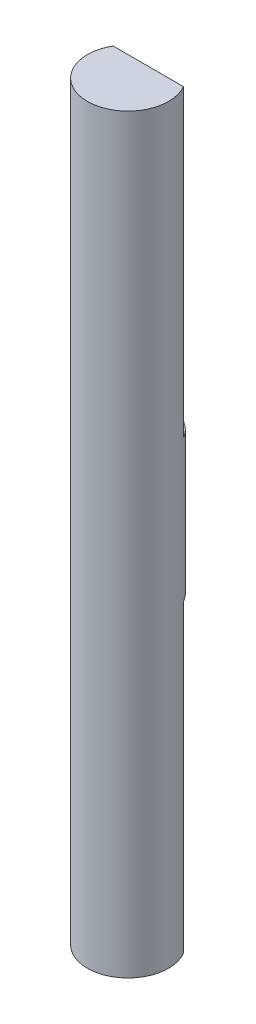
ISO-10303-21;
HEADER;
FILE_DESCRIPTION(('STEP AP214'),'2;1');
FILE_NAME('part.step','',(''),(''),'','','');
FILE_SCHEMA(('AUTOMOTIVE_DESIGN { 1 0 10303 214 1 1 1 1 }'));
ENDSEC;
DATA;
#1=APPLICATION_CONTEXT('core data for automotive mechanical design processes');
#2=APPLICATION_PROTOCOL_DEFINITION('international standard','automotive_design',2000,#1);
#3=PRODUCT_CONTEXT('',#1,'mechanical');
#4=PRODUCT('Part','Part','',(#3));
#5=PRODUCT_RELATED_PRODUCT_CATEGORY('part','',(#4));
#6=PRODUCT_DEFINITION_FORMATION('','',#4);
#7=PRODUCT_DEFINITION_CONTEXT('part definition',#1,'design');
#8=PRODUCT_DEFINITION('design','',#6,#7);
#9=PRODUCT_DEFINITION_SHAPE('','',#8);
#10=(LENGTH_UNIT() NAMED_UNIT(*) SI_UNIT(.MILLI.,.METRE.));
#11=(NAMED_UNIT(*) PLANE_ANGLE_UNIT() SI_UNIT($,.RADIAN.));
#12=(NAMED_UNIT(*) SI_UNIT($,.STERADIAN.) SOLID_ANGLE_UNIT());
#13=UNCERTAINTY_MEASURE_WITH_UNIT(LENGTH_MEASURE(1.E-05),#10,'distance_accuracy_value','');
#14=(GEOMETRIC_REPRESENTATION_CONTEXT(3) GLOBAL_UNCERTAINTY_ASSIGNED_CONTEXT((#13)) GLOBAL_UNIT_ASSIGNED_CONTEXT((#10,
#11,#12)) REPRESENTATION_CONTEXT('',''));
#15=CARTESIAN_POINT('',(0.,0.,0.));
#16=DIRECTION('',(0.,0.,1.));
#17=DIRECTION('',(1.,0.,0.));
#18=AXIS2_PLACEMENT_3D('',#15,#16,#17);
#19=CARTESIAN_POINT('',(0.,-37.,0.));
#20=DIRECTION('',(0.,1.,0.));
#21=DIRECTION('',(0.,0.,1.));
#22=AXIS2_PLACEMENT_3D('',#19,#20,#21);
#23=CYLINDRICAL_SURFACE('',#22,4.);
#24=DIRECTION('',(0.,1.,0.));
#25=VECTOR('',#24,1.);
#26=CARTESIAN_POINT('',(3.46410161513775,7.,-2.));
#27=LINE('',#26,#25);
#28=CARTESIAN_POINT('',(3.46410161513775,7.,-2.));
#29=VERTEX_POINT('',#28);
#30=CARTESIAN_POINT('',(3.46410161513775,37.,-2.));
#31=VERTEX_POINT('',#30);
#32=EDGE_CURVE('E110',#29,#31,#27,.T.);
#33=ORIENTED_EDGE('',*,*,#32,.T.);
#34=CARTESIAN_POINT('',(0.,37.,0.));
#35=DIRECTION('',(0.,1.,0.));
#36=DIRECTION('',(0.,0.,1.));
#37=AXIS2_PLACEMENT_3D('',#34,#35,#36);
#38=CIRCLE('',#37,4.);
#39=CARTESIAN_POINT('',(-3.46410161513775,37.,-2.));
#40=VERTEX_POINT('',#39);
#41=EDGE_CURVE('E46',#40,#31,#38,.T.);
#42=ORIENTED_EDGE('',*,*,#41,.F.);
#43=DIRECTION('',(0.,1.,0.));
#44=VECTOR('',#43,1.);
#45=CARTESIAN_POINT('',(-3.46410161513775,7.,-2.));
#46=LINE('',#45,#44);
#47=CARTESIAN_POINT('',(-3.46410161513775,7.,-2.));
#48=VERTEX_POINT('',#47);
#49=EDGE_CURVE('E61',#48,#40,#46,.T.);
#50=ORIENTED_EDGE('',*,*,#49,.F.);
#51=CARTESIAN_POINT('',(0.,7.,0.));
#52=DIRECTION('',(0.,1.,0.));
#53=DIRECTION('',(0.,0.,1.));
#54=AXIS2_PLACEMENT_3D('',#51,#52,#53);
#55=CIRCLE('',#54,4.);
#56=EDGE_CURVE('E101',#29,#48,#55,.T.);
#57=ORIENTED_EDGE('',*,*,#56,.F.);
#58=EDGE_LOOP('',(#33,#42,#50,#57));
#59=FACE_BOUND('',#58,.T.);
#60=CARTESIAN_POINT('',(0.,-7.,0.));
#61=DIRECTION('',(0.,1.,0.));
#62=DIRECTION('',(0.,0.,1.));
#63=AXIS2_PLACEMENT_3D('',#60,#61,#62);
#64=CIRCLE('',#63,4.);
#65=CARTESIAN_POINT('',(3.46410161513775,-7.,-2.));
#66=VERTEX_POINT('',#65);
#67=CARTESIAN_POINT('',(-3.46410161513775,-7.,-2.));
#68=VERTEX_POINT('',#67);
#69=EDGE_CURVE('E86',#66,#68,#64,.T.);
#70=ORIENTED_EDGE('',*,*,#69,.T.);
#71=DIRECTION('',(0.,-1.,0.));
#72=VECTOR('',#71,1.);
#73=CARTESIAN_POINT('',(-3.46410161513775,-7.,-2.));
#74=LINE('',#73,#72);
#75=CARTESIAN_POINT('',(-3.46410161513775,-37.,-2.));
#76=VERTEX_POINT('',#75);
#77=EDGE_CURVE('E82',#68,#76,#74,.T.);
#78=ORIENTED_EDGE('',*,*,#77,.T.);
#79=CARTESIAN_POINT('',(0.,-37.,0.));
#80=DIRECTION('',(0.,1.,0.));
#81=DIRECTION('',(0.,0.,1.));
#82=AXIS2_PLACEMENT_3D('',#79,#80,#81);
#83=CIRCLE('',#82,4.);
#84=CARTESIAN_POINT('',(3.46410161513775,-37.,-2.));
#85=VERTEX_POINT('',#84);
#86=EDGE_CURVE('E11',#76,#85,#83,.T.);
#87=ORIENTED_EDGE('',*,*,#86,.T.);
#88=DIRECTION('',(0.,-1.,0.));
#89=VECTOR('',#88,1.);
#90=CARTESIAN_POINT('',(3.46410161513775,-7.,-2.));
#91=LINE('',#90,#89);
#92=EDGE_CURVE('E53',#66,#85,#91,.T.);
#93=ORIENTED_EDGE('',*,*,#92,.F.);
#94=EDGE_LOOP('',(#70,#78,#87,#93));
#95=FACE_BOUND('',#94,.T.);
#96=ADVANCED_FACE('F38',(#59,#95),#23,.T.);
#97=CARTESIAN_POINT('',(0.,-37.,0.));
#98=DIRECTION('',(0.,1.,0.));
#99=DIRECTION('',(0.,0.,1.));
#100=AXIS2_PLACEMENT_3D('',#97,#98,#99);
#101=PLANE('',#100);
#102=DIRECTION('',(1.,0.,0.));
#103=VECTOR('',#102,1.);
#104=CARTESIAN_POINT('',(0.,-37.,-2.));
#105=LINE('',#104,#103);
#106=EDGE_CURVE('E91',#76,#85,#105,.T.);
#107=ORIENTED_EDGE('',*,*,#106,.T.);
#108=ORIENTED_EDGE('',*,*,#86,.F.);
#109=EDGE_LOOP('',(#107,#108));
#110=FACE_BOUND('',#109,.T.);
#111=ADVANCED_FACE('F135',(#110),#101,.F.);
#112=CARTESIAN_POINT('',(0.,37.,0.));
#113=DIRECTION('',(0.,1.,0.));
#114=DIRECTION('',(0.,0.,1.));
#115=AXIS2_PLACEMENT_3D('',#112,#113,#114);
#116=PLANE('',#115);
#117=DIRECTION('',(1.,0.,0.));
#118=VECTOR('',#117,1.);
#119=CARTESIAN_POINT('',(0.,37.,-2.));
#120=LINE('',#119,#118);
#121=EDGE_CURVE('E97',#40,#31,#120,.T.);
#122=ORIENTED_EDGE('',*,*,#121,.F.);
#123=ORIENTED_EDGE('',*,*,#41,.T.);
#124=EDGE_LOOP('',(#122,#123));
#125=FACE_BOUND('',#124,.T.);
#126=ADVANCED_FACE('F119',(#125),#116,.T.);
#127=CARTESIAN_POINT('',(0.,7.,-2.));
#128=DIRECTION('',(0.,0.,1.));
#129=DIRECTION('',(1.,0.,0.));
#130=AXIS2_PLACEMENT_3D('',#127,#128,#129);
#131=PLANE('',#130);
#132=ORIENTED_EDGE('',*,*,#121,.T.);
#133=ORIENTED_EDGE('',*,*,#32,.F.);
#134=DIRECTION('',(1.,0.,0.));
#135=VECTOR('',#134,1.);
#136=CARTESIAN_POINT('',(0.,7.,-2.));
#137=LINE('',#136,#135);
#138=EDGE_CURVE('E104',#48,#29,#137,.T.);
#139=ORIENTED_EDGE('',*,*,#138,.F.);
#140=ORIENTED_EDGE('',*,*,#49,.T.);
#141=EDGE_LOOP('',(#132,#133,#139,#140));
#142=FACE_BOUND('',#141,.T.);
#143=ADVANCED_FACE('F122',(#142),#131,.F.);
#144=CARTESIAN_POINT('',(0.,7.,0.));
#145=DIRECTION('',(0.,1.,0.));
#146=DIRECTION('',(0.,0.,1.));
#147=AXIS2_PLACEMENT_3D('',#144,#145,#146);
#148=PLANE('',#147);
#149=ORIENTED_EDGE('',*,*,#56,.T.);
#150=ORIENTED_EDGE('',*,*,#138,.T.);
#151=EDGE_LOOP('',(#149,#150));
#152=FACE_BOUND('',#151,.T.);
#153=ADVANCED_FACE('F124',(#152),#148,.T.);
#154=CARTESIAN_POINT('',(0.,-7.,-2.));
#155=DIRECTION('',(0.,0.,-1.));
#156=DIRECTION('',(-1.,0.,0.));
#157=AXIS2_PLACEMENT_3D('',#154,#155,#156);
#158=PLANE('',#157);
#159=ORIENTED_EDGE('',*,*,#106,.F.);
#160=ORIENTED_EDGE('',*,*,#77,.F.);
#161=DIRECTION('',(1.,0.,0.));
#162=VECTOR('',#161,1.);
#163=CARTESIAN_POINT('',(0.,-7.,-2.));
#164=LINE('',#163,#162);
#165=EDGE_CURVE('E78',#68,#66,#164,.T.);
#166=ORIENTED_EDGE('',*,*,#165,.T.);
#167=ORIENTED_EDGE('',*,*,#92,.T.);
#168=EDGE_LOOP('',(#159,#160,#166,#167));
#169=FACE_BOUND('',#168,.T.);
#170=ADVANCED_FACE('F80',(#169),#158,.T.);
#171=CARTESIAN_POINT('',(0.,-7.,0.));
#172=DIRECTION('',(0.,-1.,0.));
#173=DIRECTION('',(0.,0.,1.));
#174=AXIS2_PLACEMENT_3D('',#171,#172,#173);
#175=PLANE('',#174);
#176=ORIENTED_EDGE('',*,*,#69,.F.);
#177=ORIENTED_EDGE('',*,*,#165,.F.);
#178=EDGE_LOOP('',(#176,#177));
#179=FACE_BOUND('',#178,.T.);
#180=ADVANCED_FACE('F88',(#179),#175,.T.);
#181=CLOSED_SHELL('',(#96,#111,#126,#143,#153,#170,#180));
#182=MANIFOLD_SOLID_BREP('B2',#181);
#183=ADVANCED_BREP_SHAPE_REPRESENTATION('',(#18,#182),#14);
#184=SHAPE_DEFINITION_REPRESENTATION(#9,#183);
ENDSEC;
END-ISO-10303-21;
